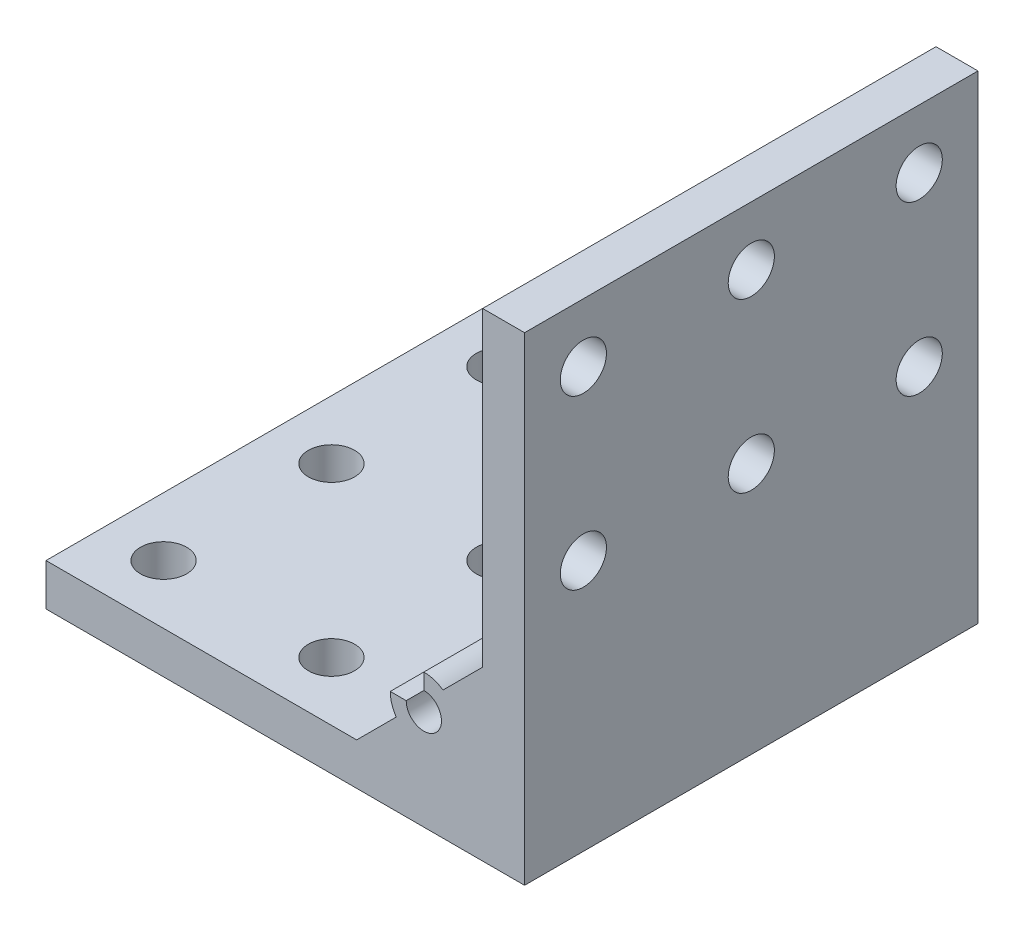
ISO-10303-21;
HEADER;
FILE_DESCRIPTION(('STEP AP214'),'2;1');
FILE_NAME('part.step','',(''),(''),'','','');
FILE_SCHEMA(('AUTOMOTIVE_DESIGN { 1 0 10303 214 1 1 1 1 }'));
ENDSEC;
DATA;
#1=APPLICATION_CONTEXT('core data for automotive mechanical design processes');
#2=APPLICATION_PROTOCOL_DEFINITION('international standard','automotive_design',2000,#1);
#3=PRODUCT_CONTEXT('',#1,'mechanical');
#4=PRODUCT('Part','Part','',(#3));
#5=PRODUCT_RELATED_PRODUCT_CATEGORY('part','',(#4));
#6=PRODUCT_DEFINITION_FORMATION('','',#4);
#7=PRODUCT_DEFINITION_CONTEXT('part definition',#1,'design');
#8=PRODUCT_DEFINITION('design','',#6,#7);
#9=PRODUCT_DEFINITION_SHAPE('','',#8);
#10=(LENGTH_UNIT() NAMED_UNIT(*) SI_UNIT(.MILLI.,.METRE.));
#11=(NAMED_UNIT(*) PLANE_ANGLE_UNIT() SI_UNIT($,.RADIAN.));
#12=(NAMED_UNIT(*) SI_UNIT($,.STERADIAN.) SOLID_ANGLE_UNIT());
#13=UNCERTAINTY_MEASURE_WITH_UNIT(LENGTH_MEASURE(1.E-05),#10,'distance_accuracy_value','');
#14=(GEOMETRIC_REPRESENTATION_CONTEXT(3) GLOBAL_UNCERTAINTY_ASSIGNED_CONTEXT((#13)) GLOBAL_UNIT_ASSIGNED_CONTEXT((#10,
#11,#12)) REPRESENTATION_CONTEXT('',''));
#15=CARTESIAN_POINT('',(0.,0.,0.));
#16=DIRECTION('',(0.,0.,1.));
#17=DIRECTION('',(1.,0.,0.));
#18=AXIS2_PLACEMENT_3D('',#15,#16,#17);
#19=CARTESIAN_POINT('',(0.,0.,27.));
#20=DIRECTION('',(0.,0.,-1.));
#21=DIRECTION('',(-1.,0.,0.));
#22=AXIS2_PLACEMENT_3D('',#19,#20,#21);
#23=CYLINDRICAL_SURFACE('',#22,2.1);
#24=DIRECTION('',(0.,0.,-1.));
#25=VECTOR('',#24,1.);
#26=CARTESIAN_POINT('',(0.,2.1,27.));
#27=LINE('',#26,#25);
#28=CARTESIAN_POINT('',(0.,2.1,27.));
#29=VERTEX_POINT('',#28);
#30=CARTESIAN_POINT('',(0.,2.1,-27.));
#31=VERTEX_POINT('',#30);
#32=EDGE_CURVE('E143',#29,#31,#27,.T.);
#33=ORIENTED_EDGE('',*,*,#32,.T.);
#34=CARTESIAN_POINT('',(0.,0.,-27.));
#35=DIRECTION('',(0.,0.,-1.));
#36=DIRECTION('',(1.,0.,0.));
#37=AXIS2_PLACEMENT_3D('',#34,#35,#36);
#38=CIRCLE('',#37,2.1);
#39=CARTESIAN_POINT('',(-2.1,0.,-27.));
#40=VERTEX_POINT('',#39);
#41=EDGE_CURVE('E137',#31,#40,#38,.T.);
#42=ORIENTED_EDGE('',*,*,#41,.T.);
#43=DIRECTION('',(0.,0.,-1.));
#44=VECTOR('',#43,1.);
#45=CARTESIAN_POINT('',(-2.1,0.,27.));
#46=LINE('',#45,#44);
#47=CARTESIAN_POINT('',(-2.1,0.,27.));
#48=VERTEX_POINT('',#47);
#49=EDGE_CURVE('E11',#48,#40,#46,.T.);
#50=ORIENTED_EDGE('',*,*,#49,.F.);
#51=CARTESIAN_POINT('',(0.,0.,27.));
#52=DIRECTION('',(0.,0.,-1.));
#53=DIRECTION('',(1.,0.,0.));
#54=AXIS2_PLACEMENT_3D('',#51,#52,#53);
#55=CIRCLE('',#54,2.1);
#56=EDGE_CURVE('E181',#29,#48,#55,.T.);
#57=ORIENTED_EDGE('',*,*,#56,.F.);
#58=EDGE_LOOP('',(#33,#42,#50,#57));
#59=FACE_BOUND('',#58,.T.);
#60=ADVANCED_FACE('F31',(#59),#23,.F.);
#61=CARTESIAN_POINT('',(-2.1,0.,27.));
#62=DIRECTION('',(0.,-1.,0.));
#63=DIRECTION('',(1.,0.,0.));
#64=AXIS2_PLACEMENT_3D('',#61,#62,#63);
#65=PLANE('',#64);
#66=ORIENTED_EDGE('',*,*,#49,.T.);
#67=DIRECTION('',(-1.,0.,0.));
#68=VECTOR('',#67,1.);
#69=CARTESIAN_POINT('',(-2.1,0.,-27.));
#70=LINE('',#69,#68);
#71=CARTESIAN_POINT('',(-4.,0.,-27.));
#72=VERTEX_POINT('',#71);
#73=EDGE_CURVE('E127',#40,#72,#70,.T.);
#74=ORIENTED_EDGE('',*,*,#73,.T.);
#75=DIRECTION('',(0.,0.,-1.));
#76=VECTOR('',#75,1.);
#77=CARTESIAN_POINT('',(-4.,0.,27.));
#78=LINE('',#77,#76);
#79=CARTESIAN_POINT('',(-4.,0.,27.));
#80=VERTEX_POINT('',#79);
#81=EDGE_CURVE('E38',#80,#72,#78,.T.);
#82=ORIENTED_EDGE('',*,*,#81,.F.);
#83=DIRECTION('',(-1.,0.,0.));
#84=VECTOR('',#83,1.);
#85=CARTESIAN_POINT('',(-2.1,0.,27.));
#86=LINE('',#85,#84);
#87=EDGE_CURVE('E128',#48,#80,#86,.T.);
#88=ORIENTED_EDGE('',*,*,#87,.F.);
#89=EDGE_LOOP('',(#66,#74,#82,#88));
#90=FACE_BOUND('',#89,.T.);
#91=ADVANCED_FACE('F125',(#90),#65,.F.);
#92=CARTESIAN_POINT('',(0.,0.,27.));
#93=DIRECTION('',(0.,0.,-1.));
#94=DIRECTION('',(-1.,0.,0.));
#95=AXIS2_PLACEMENT_3D('',#92,#93,#94);
#96=CYLINDRICAL_SURFACE('',#95,4.);
#97=ORIENTED_EDGE('',*,*,#81,.T.);
#98=CARTESIAN_POINT('',(0.,0.,-27.));
#99=DIRECTION('',(0.,0.,1.));
#100=DIRECTION('',(1.,0.,0.));
#101=AXIS2_PLACEMENT_3D('',#98,#99,#100);
#102=CIRCLE('',#101,4.);
#103=CARTESIAN_POINT('',(-3.28388218141501,-2.28388218141501,-27.));
#104=VERTEX_POINT('',#103);
#105=EDGE_CURVE('E141',#72,#104,#102,.T.);
#106=ORIENTED_EDGE('',*,*,#105,.T.);
#107=DIRECTION('',(0.,0.,-1.));
#108=VECTOR('',#107,1.);
#109=CARTESIAN_POINT('',(-3.28388218141501,-2.28388218141501,27.));
#110=LINE('',#109,#108);
#111=CARTESIAN_POINT('',(-3.28388218141501,-2.28388218141501,27.));
#112=VERTEX_POINT('',#111);
#113=EDGE_CURVE('E223',#112,#104,#110,.T.);
#114=ORIENTED_EDGE('',*,*,#113,.F.);
#115=CARTESIAN_POINT('',(0.,0.,27.));
#116=DIRECTION('',(0.,0.,1.));
#117=DIRECTION('',(1.,0.,0.));
#118=AXIS2_PLACEMENT_3D('',#115,#116,#117);
#119=CIRCLE('',#118,4.);
#120=EDGE_CURVE('E184',#80,#112,#119,.T.);
#121=ORIENTED_EDGE('',*,*,#120,.F.);
#122=EDGE_LOOP('',(#97,#106,#114,#121));
#123=FACE_BOUND('',#122,.T.);
#124=ADVANCED_FACE('F226',(#123),#96,.T.);
#125=CARTESIAN_POINT('',(-8.,-7.00000000000001,27.));
#126=DIRECTION('',(0.707106781186547,-0.707106781186547,0.));
#127=DIRECTION('',(0.707106781186548,0.707106781186548,0.));
#128=AXIS2_PLACEMENT_3D('',#125,#126,#127);
#129=PLANE('',#128);
#130=ORIENTED_EDGE('',*,*,#113,.T.);
#131=DIRECTION('',(-0.707106781186548,-0.707106781186548,0.));
#132=VECTOR('',#131,1.);
#133=CARTESIAN_POINT('',(-8.,-7.00000000000001,-27.));
#134=LINE('',#133,#132);
#135=CARTESIAN_POINT('',(-8.,-7.00000000000001,-27.));
#136=VERTEX_POINT('',#135);
#137=EDGE_CURVE('E152',#104,#136,#134,.T.);
#138=ORIENTED_EDGE('',*,*,#137,.T.);
#139=DIRECTION('',(0.,0.,-1.));
#140=VECTOR('',#139,1.);
#141=CARTESIAN_POINT('',(-8.,-7.00000000000001,27.));
#142=LINE('',#141,#140);
#143=CARTESIAN_POINT('',(-8.,-7.00000000000001,27.));
#144=VERTEX_POINT('',#143);
#145=EDGE_CURVE('E221',#144,#136,#142,.T.);
#146=ORIENTED_EDGE('',*,*,#145,.F.);
#147=DIRECTION('',(-0.707106781186548,-0.707106781186548,0.));
#148=VECTOR('',#147,1.);
#149=CARTESIAN_POINT('',(-8.,-7.00000000000001,27.));
#150=LINE('',#149,#148);
#151=EDGE_CURVE('E186',#112,#144,#150,.T.);
#152=ORIENTED_EDGE('',*,*,#151,.F.);
#153=EDGE_LOOP('',(#130,#138,#146,#152));
#154=FACE_BOUND('',#153,.T.);
#155=ADVANCED_FACE('F234',(#154),#129,.F.);
#156=CARTESIAN_POINT('',(-45.,-7.,27.));
#157=DIRECTION('',(0.,-1.,0.));
#158=DIRECTION('',(1.,0.,0.));
#159=AXIS2_PLACEMENT_3D('',#156,#157,#158);
#160=PLANE('',#159);
#161=CARTESIAN_POINT('',(-18.,-7.00000000000001,20.));
#162=DIRECTION('',(0.,-1.,0.));
#163=DIRECTION('',(1.,0.,0.));
#164=AXIS2_PLACEMENT_3D('',#161,#162,#163);
#165=CIRCLE('',#164,2.75);
#166=CARTESIAN_POINT('',(-15.25,-7.00000000000001,20.));
#167=VERTEX_POINT('',#166);
#168=EDGE_CURVE('E491',#167,#167,#165,.F.);
#169=ORIENTED_EDGE('',*,*,#168,.F.);
#170=EDGE_LOOP('',(#169));
#171=FACE_BOUND('',#170,.T.);
#172=CARTESIAN_POINT('',(-18.,-7.00000000000001,0.));
#173=DIRECTION('',(0.,-1.,0.));
#174=DIRECTION('',(1.,0.,0.));
#175=AXIS2_PLACEMENT_3D('',#172,#173,#174);
#176=CIRCLE('',#175,2.75);
#177=CARTESIAN_POINT('',(-15.25,-7.00000000000001,0.));
#178=VERTEX_POINT('',#177);
#179=EDGE_CURVE('E495',#178,#178,#176,.F.);
#180=ORIENTED_EDGE('',*,*,#179,.F.);
#181=EDGE_LOOP('',(#180));
#182=FACE_BOUND('',#181,.T.);
#183=CARTESIAN_POINT('',(-18.,-7.00000000000001,-20.));
#184=DIRECTION('',(0.,-1.,0.));
#185=DIRECTION('',(1.,0.,0.));
#186=AXIS2_PLACEMENT_3D('',#183,#184,#185);
#187=CIRCLE('',#186,2.75);
#188=CARTESIAN_POINT('',(-15.25,-7.00000000000001,-20.));
#189=VERTEX_POINT('',#188);
#190=EDGE_CURVE('E504',#189,#189,#187,.F.);
#191=ORIENTED_EDGE('',*,*,#190,.F.);
#192=EDGE_LOOP('',(#191));
#193=FACE_BOUND('',#192,.T.);
#194=CARTESIAN_POINT('',(-38.,-7.,20.));
#195=DIRECTION('',(0.,-1.,0.));
#196=DIRECTION('',(1.,0.,0.));
#197=AXIS2_PLACEMENT_3D('',#194,#195,#196);
#198=CIRCLE('',#197,2.75);
#199=CARTESIAN_POINT('',(-35.25,-7.,20.));
#200=VERTEX_POINT('',#199);
#201=EDGE_CURVE('E510',#200,#200,#198,.F.);
#202=ORIENTED_EDGE('',*,*,#201,.F.);
#203=EDGE_LOOP('',(#202));
#204=FACE_BOUND('',#203,.T.);
#205=CARTESIAN_POINT('',(-38.,-7.,0.));
#206=DIRECTION('',(0.,-1.,0.));
#207=DIRECTION('',(1.,0.,0.));
#208=AXIS2_PLACEMENT_3D('',#205,#206,#207);
#209=CIRCLE('',#208,2.75);
#210=CARTESIAN_POINT('',(-35.25,-7.,0.));
#211=VERTEX_POINT('',#210);
#212=EDGE_CURVE('E516',#211,#211,#209,.F.);
#213=ORIENTED_EDGE('',*,*,#212,.F.);
#214=EDGE_LOOP('',(#213));
#215=FACE_BOUND('',#214,.T.);
#216=CARTESIAN_POINT('',(-38.,-7.,-20.));
#217=DIRECTION('',(0.,-1.,0.));
#218=DIRECTION('',(1.,0.,0.));
#219=AXIS2_PLACEMENT_3D('',#216,#217,#218);
#220=CIRCLE('',#219,2.75);
#221=CARTESIAN_POINT('',(-35.25,-7.,-20.));
#222=VERTEX_POINT('',#221);
#223=EDGE_CURVE('E522',#222,#222,#220,.F.);
#224=ORIENTED_EDGE('',*,*,#223,.F.);
#225=EDGE_LOOP('',(#224));
#226=FACE_BOUND('',#225,.T.);
#227=ORIENTED_EDGE('',*,*,#145,.T.);
#228=DIRECTION('',(-1.,0.,0.));
#229=VECTOR('',#228,1.);
#230=CARTESIAN_POINT('',(-45.,-7.,-27.));
#231=LINE('',#230,#229);
#232=CARTESIAN_POINT('',(-45.,-7.,-27.));
#233=VERTEX_POINT('',#232);
#234=EDGE_CURVE('E155',#136,#233,#231,.T.);
#235=ORIENTED_EDGE('',*,*,#234,.T.);
#236=DIRECTION('',(0.,0.,-1.));
#237=VECTOR('',#236,1.);
#238=CARTESIAN_POINT('',(-45.,-7.,27.));
#239=LINE('',#238,#237);
#240=CARTESIAN_POINT('',(-45.,-7.,27.));
#241=VERTEX_POINT('',#240);
#242=EDGE_CURVE('E219',#241,#233,#239,.T.);
#243=ORIENTED_EDGE('',*,*,#242,.F.);
#244=DIRECTION('',(-1.,0.,0.));
#245=VECTOR('',#244,1.);
#246=CARTESIAN_POINT('',(-45.,-7.,27.));
#247=LINE('',#246,#245);
#248=EDGE_CURVE('E188',#144,#241,#247,.T.);
#249=ORIENTED_EDGE('',*,*,#248,.F.);
#250=EDGE_LOOP('',(#227,#235,#243,#249));
#251=FACE_BOUND('',#250,.T.);
#252=ADVANCED_FACE('F237',(#171,#182,#193,#204,#215,#226,#251),#160,.F.);
#253=CARTESIAN_POINT('',(-45.,-12.,27.));
#254=DIRECTION('',(1.,0.,0.));
#255=DIRECTION('',(0.,1.,0.));
#256=AXIS2_PLACEMENT_3D('',#253,#254,#255);
#257=PLANE('',#256);
#258=ORIENTED_EDGE('',*,*,#242,.T.);
#259=DIRECTION('',(0.,-1.,0.));
#260=VECTOR('',#259,1.);
#261=CARTESIAN_POINT('',(-45.,-12.,-27.));
#262=LINE('',#261,#260);
#263=CARTESIAN_POINT('',(-45.,-12.,-27.));
#264=VERTEX_POINT('',#263);
#265=EDGE_CURVE('E158',#233,#264,#262,.T.);
#266=ORIENTED_EDGE('',*,*,#265,.T.);
#267=DIRECTION('',(0.,0.,-1.));
#268=VECTOR('',#267,1.);
#269=CARTESIAN_POINT('',(-45.,-12.,27.));
#270=LINE('',#269,#268);
#271=CARTESIAN_POINT('',(-45.,-12.,27.));
#272=VERTEX_POINT('',#271);
#273=EDGE_CURVE('E217',#272,#264,#270,.T.);
#274=ORIENTED_EDGE('',*,*,#273,.F.);
#275=DIRECTION('',(0.,-1.,0.));
#276=VECTOR('',#275,1.);
#277=CARTESIAN_POINT('',(-45.,-12.,27.));
#278=LINE('',#277,#276);
#279=EDGE_CURVE('E190',#241,#272,#278,.T.);
#280=ORIENTED_EDGE('',*,*,#279,.F.);
#281=EDGE_LOOP('',(#258,#266,#274,#280));
#282=FACE_BOUND('',#281,.T.);
#283=ADVANCED_FACE('F242',(#282),#257,.F.);
#284=CARTESIAN_POINT('',(12.,-12.,27.));
#285=DIRECTION('',(0.,1.,0.));
#286=DIRECTION('',(-1.,0.,0.));
#287=AXIS2_PLACEMENT_3D('',#284,#285,#286);
#288=PLANE('',#287);
#289=CARTESIAN_POINT('',(-18.,-12.,20.));
#290=DIRECTION('',(0.,-1.,0.));
#291=DIRECTION('',(1.,0.,0.));
#292=AXIS2_PLACEMENT_3D('',#289,#290,#291);
#293=CIRCLE('',#292,2.75);
#294=CARTESIAN_POINT('',(-15.25,-12.,20.));
#295=VERTEX_POINT('',#294);
#296=EDGE_CURVE('E488',#295,#295,#293,.T.);
#297=ORIENTED_EDGE('',*,*,#296,.F.);
#298=EDGE_LOOP('',(#297));
#299=FACE_BOUND('',#298,.T.);
#300=CARTESIAN_POINT('',(-18.,-12.,0.));
#301=DIRECTION('',(0.,-1.,0.));
#302=DIRECTION('',(1.,0.,0.));
#303=AXIS2_PLACEMENT_3D('',#300,#301,#302);
#304=CIRCLE('',#303,2.75);
#305=CARTESIAN_POINT('',(-15.25,-12.,0.));
#306=VERTEX_POINT('',#305);
#307=EDGE_CURVE('E492',#306,#306,#304,.T.);
#308=ORIENTED_EDGE('',*,*,#307,.F.);
#309=EDGE_LOOP('',(#308));
#310=FACE_BOUND('',#309,.T.);
#311=CARTESIAN_POINT('',(-18.,-12.,-20.));
#312=DIRECTION('',(0.,-1.,0.));
#313=DIRECTION('',(1.,0.,0.));
#314=AXIS2_PLACEMENT_3D('',#311,#312,#313);
#315=CIRCLE('',#314,2.75);
#316=CARTESIAN_POINT('',(-15.25,-12.,-20.));
#317=VERTEX_POINT('',#316);
#318=EDGE_CURVE('E501',#317,#317,#315,.T.);
#319=ORIENTED_EDGE('',*,*,#318,.F.);
#320=EDGE_LOOP('',(#319));
#321=FACE_BOUND('',#320,.T.);
#322=CARTESIAN_POINT('',(-38.,-12.,20.));
#323=DIRECTION('',(0.,-1.,0.));
#324=DIRECTION('',(1.,0.,0.));
#325=AXIS2_PLACEMENT_3D('',#322,#323,#324);
#326=CIRCLE('',#325,2.75);
#327=CARTESIAN_POINT('',(-35.25,-12.,20.));
#328=VERTEX_POINT('',#327);
#329=EDGE_CURVE('E507',#328,#328,#326,.T.);
#330=ORIENTED_EDGE('',*,*,#329,.F.);
#331=EDGE_LOOP('',(#330));
#332=FACE_BOUND('',#331,.T.);
#333=CARTESIAN_POINT('',(-38.,-12.,0.));
#334=DIRECTION('',(0.,-1.,0.));
#335=DIRECTION('',(1.,0.,0.));
#336=AXIS2_PLACEMENT_3D('',#333,#334,#335);
#337=CIRCLE('',#336,2.75);
#338=CARTESIAN_POINT('',(-35.25,-12.,0.));
#339=VERTEX_POINT('',#338);
#340=EDGE_CURVE('E513',#339,#339,#337,.T.);
#341=ORIENTED_EDGE('',*,*,#340,.F.);
#342=EDGE_LOOP('',(#341));
#343=FACE_BOUND('',#342,.T.);
#344=CARTESIAN_POINT('',(-38.,-12.,-20.));
#345=DIRECTION('',(0.,-1.,0.));
#346=DIRECTION('',(1.,0.,0.));
#347=AXIS2_PLACEMENT_3D('',#344,#345,#346);
#348=CIRCLE('',#347,2.75);
#349=CARTESIAN_POINT('',(-35.25,-12.,-20.));
#350=VERTEX_POINT('',#349);
#351=EDGE_CURVE('E519',#350,#350,#348,.T.);
#352=ORIENTED_EDGE('',*,*,#351,.F.);
#353=EDGE_LOOP('',(#352));
#354=FACE_BOUND('',#353,.T.);
#355=ORIENTED_EDGE('',*,*,#273,.T.);
#356=DIRECTION('',(1.,0.,0.));
#357=VECTOR('',#356,1.);
#358=CARTESIAN_POINT('',(12.,-12.,-27.));
#359=LINE('',#358,#357);
#360=CARTESIAN_POINT('',(12.,-12.,-27.));
#361=VERTEX_POINT('',#360);
#362=EDGE_CURVE('E161',#264,#361,#359,.T.);
#363=ORIENTED_EDGE('',*,*,#362,.T.);
#364=DIRECTION('',(0.,0.,-1.));
#365=VECTOR('',#364,1.);
#366=CARTESIAN_POINT('',(12.,-12.,27.));
#367=LINE('',#366,#365);
#368=CARTESIAN_POINT('',(12.,-12.,27.));
#369=VERTEX_POINT('',#368);
#370=EDGE_CURVE('E215',#369,#361,#367,.T.);
#371=ORIENTED_EDGE('',*,*,#370,.F.);
#372=DIRECTION('',(1.,0.,0.));
#373=VECTOR('',#372,1.);
#374=CARTESIAN_POINT('',(12.,-12.,27.));
#375=LINE('',#374,#373);
#376=EDGE_CURVE('E192',#272,#369,#375,.T.);
#377=ORIENTED_EDGE('',*,*,#376,.F.);
#378=EDGE_LOOP('',(#355,#363,#371,#377));
#379=FACE_BOUND('',#378,.T.);
#380=ADVANCED_FACE('F248',(#299,#310,#321,#332,#343,#354,#379),#288,.F.);
#381=CARTESIAN_POINT('',(12.,45.,27.));
#382=DIRECTION('',(-1.,0.,0.));
#383=DIRECTION('',(0.,-1.,0.));
#384=AXIS2_PLACEMENT_3D('',#381,#382,#383);
#385=PLANE('',#384);
#386=CARTESIAN_POINT('',(12.,18.,-20.));
#387=DIRECTION('',(1.,0.,0.));
#388=DIRECTION('',(0.,1.,0.));
#389=AXIS2_PLACEMENT_3D('',#386,#387,#388);
#390=CIRCLE('',#389,2.75);
#391=CARTESIAN_POINT('',(12.,20.75,-20.));
#392=VERTEX_POINT('',#391);
#393=EDGE_CURVE('E525',#392,#392,#390,.T.);
#394=ORIENTED_EDGE('',*,*,#393,.F.);
#395=EDGE_LOOP('',(#394));
#396=FACE_BOUND('',#395,.T.);
#397=CARTESIAN_POINT('',(12.,18.,0.));
#398=DIRECTION('',(1.,0.,0.));
#399=DIRECTION('',(0.,1.,0.));
#400=AXIS2_PLACEMENT_3D('',#397,#398,#399);
#401=CIRCLE('',#400,2.75);
#402=CARTESIAN_POINT('',(12.,20.75,0.));
#403=VERTEX_POINT('',#402);
#404=EDGE_CURVE('E531',#403,#403,#401,.T.);
#405=ORIENTED_EDGE('',*,*,#404,.F.);
#406=EDGE_LOOP('',(#405));
#407=FACE_BOUND('',#406,.T.);
#408=CARTESIAN_POINT('',(12.,18.,20.));
#409=DIRECTION('',(1.,0.,0.));
#410=DIRECTION('',(0.,1.,0.));
#411=AXIS2_PLACEMENT_3D('',#408,#409,#410);
#412=CIRCLE('',#411,2.75);
#413=CARTESIAN_POINT('',(12.,20.75,20.));
#414=VERTEX_POINT('',#413);
#415=EDGE_CURVE('E537',#414,#414,#412,.T.);
#416=ORIENTED_EDGE('',*,*,#415,.F.);
#417=EDGE_LOOP('',(#416));
#418=FACE_BOUND('',#417,.T.);
#419=CARTESIAN_POINT('',(12.,38.,-20.));
#420=DIRECTION('',(1.,0.,0.));
#421=DIRECTION('',(0.,1.,0.));
#422=AXIS2_PLACEMENT_3D('',#419,#420,#421);
#423=CIRCLE('',#422,2.75);
#424=CARTESIAN_POINT('',(12.,40.75,-20.));
#425=VERTEX_POINT('',#424);
#426=EDGE_CURVE('E543',#425,#425,#423,.T.);
#427=ORIENTED_EDGE('',*,*,#426,.F.);
#428=EDGE_LOOP('',(#427));
#429=FACE_BOUND('',#428,.T.);
#430=CARTESIAN_POINT('',(12.,38.,0.));
#431=DIRECTION('',(1.,0.,0.));
#432=DIRECTION('',(0.,1.,0.));
#433=AXIS2_PLACEMENT_3D('',#430,#431,#432);
#434=CIRCLE('',#433,2.75);
#435=CARTESIAN_POINT('',(12.,40.75,0.));
#436=VERTEX_POINT('',#435);
#437=EDGE_CURVE('E549',#436,#436,#434,.T.);
#438=ORIENTED_EDGE('',*,*,#437,.F.);
#439=EDGE_LOOP('',(#438));
#440=FACE_BOUND('',#439,.T.);
#441=CARTESIAN_POINT('',(12.,38.,20.));
#442=DIRECTION('',(1.,0.,0.));
#443=DIRECTION('',(0.,1.,0.));
#444=AXIS2_PLACEMENT_3D('',#441,#442,#443);
#445=CIRCLE('',#444,2.75);
#446=CARTESIAN_POINT('',(12.,40.75,20.));
#447=VERTEX_POINT('',#446);
#448=EDGE_CURVE('E147',#447,#447,#445,.T.);
#449=ORIENTED_EDGE('',*,*,#448,.F.);
#450=EDGE_LOOP('',(#449));
#451=FACE_BOUND('',#450,.T.);
#452=ORIENTED_EDGE('',*,*,#370,.T.);
#453=DIRECTION('',(0.,1.,0.));
#454=VECTOR('',#453,1.);
#455=CARTESIAN_POINT('',(12.,45.,-27.));
#456=LINE('',#455,#454);
#457=CARTESIAN_POINT('',(12.,45.,-27.));
#458=VERTEX_POINT('',#457);
#459=EDGE_CURVE('E164',#361,#458,#456,.T.);
#460=ORIENTED_EDGE('',*,*,#459,.T.);
#461=DIRECTION('',(0.,0.,-1.));
#462=VECTOR('',#461,1.);
#463=CARTESIAN_POINT('',(12.,45.,27.));
#464=LINE('',#463,#462);
#465=CARTESIAN_POINT('',(12.,45.,27.));
#466=VERTEX_POINT('',#465);
#467=EDGE_CURVE('E213',#466,#458,#464,.T.);
#468=ORIENTED_EDGE('',*,*,#467,.F.);
#469=DIRECTION('',(0.,1.,0.));
#470=VECTOR('',#469,1.);
#471=CARTESIAN_POINT('',(12.,45.,27.));
#472=LINE('',#471,#470);
#473=EDGE_CURVE('E194',#369,#466,#472,.T.);
#474=ORIENTED_EDGE('',*,*,#473,.F.);
#475=EDGE_LOOP('',(#452,#460,#468,#474));
#476=FACE_BOUND('',#475,.T.);
#477=ADVANCED_FACE('F252',(#396,#407,#418,#429,#440,#451,#476),#385,.F.);
#478=CARTESIAN_POINT('',(7.00000000000001,45.,27.));
#479=DIRECTION('',(0.,-1.,0.));
#480=DIRECTION('',(0.,0.,-1.));
#481=AXIS2_PLACEMENT_3D('',#478,#479,#480);
#482=PLANE('',#481);
#483=ORIENTED_EDGE('',*,*,#467,.T.);
#484=DIRECTION('',(-1.,0.,0.));
#485=VECTOR('',#484,1.);
#486=CARTESIAN_POINT('',(7.00000000000001,45.,-27.));
#487=LINE('',#486,#485);
#488=CARTESIAN_POINT('',(7.00000000000001,45.,-27.));
#489=VERTEX_POINT('',#488);
#490=EDGE_CURVE('E167',#458,#489,#487,.T.);
#491=ORIENTED_EDGE('',*,*,#490,.T.);
#492=DIRECTION('',(0.,0.,-1.));
#493=VECTOR('',#492,1.);
#494=CARTESIAN_POINT('',(7.00000000000001,45.,27.));
#495=LINE('',#494,#493);
#496=CARTESIAN_POINT('',(7.00000000000001,45.,27.));
#497=VERTEX_POINT('',#496);
#498=EDGE_CURVE('E211',#497,#489,#495,.T.);
#499=ORIENTED_EDGE('',*,*,#498,.F.);
#500=DIRECTION('',(-1.,0.,0.));
#501=VECTOR('',#500,1.);
#502=CARTESIAN_POINT('',(7.00000000000001,45.,27.));
#503=LINE('',#502,#501);
#504=EDGE_CURVE('E196',#466,#497,#503,.T.);
#505=ORIENTED_EDGE('',*,*,#504,.F.);
#506=EDGE_LOOP('',(#483,#491,#499,#505));
#507=FACE_BOUND('',#506,.T.);
#508=ADVANCED_FACE('F257',(#507),#482,.F.);
#509=CARTESIAN_POINT('',(7.00000000000001,8.,27.));
#510=DIRECTION('',(1.,0.,0.));
#511=DIRECTION('',(0.,0.,-1.));
#512=AXIS2_PLACEMENT_3D('',#509,#510,#511);
#513=PLANE('',#512);
#514=CARTESIAN_POINT('',(7.00000000000001,18.,-20.));
#515=DIRECTION('',(1.,0.,0.));
#516=DIRECTION('',(0.,0.,-1.));
#517=AXIS2_PLACEMENT_3D('',#514,#515,#516);
#518=CIRCLE('',#517,2.75);
#519=CARTESIAN_POINT('',(7.00000000000001,18.,-22.75));
#520=VERTEX_POINT('',#519);
#521=EDGE_CURVE('E528',#520,#520,#518,.F.);
#522=ORIENTED_EDGE('',*,*,#521,.F.);
#523=EDGE_LOOP('',(#522));
#524=FACE_BOUND('',#523,.T.);
#525=CARTESIAN_POINT('',(7.00000000000001,18.,0.));
#526=DIRECTION('',(1.,0.,0.));
#527=DIRECTION('',(0.,0.,-1.));
#528=AXIS2_PLACEMENT_3D('',#525,#526,#527);
#529=CIRCLE('',#528,2.75);
#530=CARTESIAN_POINT('',(7.00000000000001,18.,-2.75));
#531=VERTEX_POINT('',#530);
#532=EDGE_CURVE('E534',#531,#531,#529,.F.);
#533=ORIENTED_EDGE('',*,*,#532,.F.);
#534=EDGE_LOOP('',(#533));
#535=FACE_BOUND('',#534,.T.);
#536=CARTESIAN_POINT('',(7.00000000000001,18.,20.));
#537=DIRECTION('',(1.,0.,0.));
#538=DIRECTION('',(0.,0.,-1.));
#539=AXIS2_PLACEMENT_3D('',#536,#537,#538);
#540=CIRCLE('',#539,2.75);
#541=CARTESIAN_POINT('',(7.00000000000001,18.,17.25));
#542=VERTEX_POINT('',#541);
#543=EDGE_CURVE('E540',#542,#542,#540,.F.);
#544=ORIENTED_EDGE('',*,*,#543,.F.);
#545=EDGE_LOOP('',(#544));
#546=FACE_BOUND('',#545,.T.);
#547=CARTESIAN_POINT('',(7.00000000000001,38.,-20.));
#548=DIRECTION('',(1.,0.,0.));
#549=DIRECTION('',(0.,0.,-1.));
#550=AXIS2_PLACEMENT_3D('',#547,#548,#549);
#551=CIRCLE('',#550,2.75);
#552=CARTESIAN_POINT('',(7.00000000000001,38.,-22.75));
#553=VERTEX_POINT('',#552);
#554=EDGE_CURVE('E546',#553,#553,#551,.F.);
#555=ORIENTED_EDGE('',*,*,#554,.F.);
#556=EDGE_LOOP('',(#555));
#557=FACE_BOUND('',#556,.T.);
#558=CARTESIAN_POINT('',(7.00000000000001,38.,0.));
#559=DIRECTION('',(1.,0.,0.));
#560=DIRECTION('',(0.,0.,-1.));
#561=AXIS2_PLACEMENT_3D('',#558,#559,#560);
#562=CIRCLE('',#561,2.75);
#563=CARTESIAN_POINT('',(7.00000000000001,38.,-2.75));
#564=VERTEX_POINT('',#563);
#565=EDGE_CURVE('E552',#564,#564,#562,.F.);
#566=ORIENTED_EDGE('',*,*,#565,.F.);
#567=EDGE_LOOP('',(#566));
#568=FACE_BOUND('',#567,.T.);
#569=CARTESIAN_POINT('',(7.00000000000001,38.,20.));
#570=DIRECTION('',(1.,0.,0.));
#571=DIRECTION('',(0.,0.,-1.));
#572=AXIS2_PLACEMENT_3D('',#569,#570,#571);
#573=CIRCLE('',#572,2.75);
#574=CARTESIAN_POINT('',(7.00000000000001,38.,17.25));
#575=VERTEX_POINT('',#574);
#576=EDGE_CURVE('E144',#575,#575,#573,.F.);
#577=ORIENTED_EDGE('',*,*,#576,.F.);
#578=EDGE_LOOP('',(#577));
#579=FACE_BOUND('',#578,.T.);
#580=ORIENTED_EDGE('',*,*,#498,.T.);
#581=DIRECTION('',(0.,-1.,0.));
#582=VECTOR('',#581,1.);
#583=CARTESIAN_POINT('',(7.00000000000001,8.,-27.));
#584=LINE('',#583,#582);
#585=CARTESIAN_POINT('',(7.00000000000001,8.,-27.));
#586=VERTEX_POINT('',#585);
#587=EDGE_CURVE('E170',#489,#586,#584,.T.);
#588=ORIENTED_EDGE('',*,*,#587,.T.);
#589=DIRECTION('',(0.,0.,-1.));
#590=VECTOR('',#589,1.);
#591=CARTESIAN_POINT('',(7.00000000000001,8.,27.));
#592=LINE('',#591,#590);
#593=CARTESIAN_POINT('',(7.00000000000001,8.,27.));
#594=VERTEX_POINT('',#593);
#595=EDGE_CURVE('E209',#594,#586,#592,.T.);
#596=ORIENTED_EDGE('',*,*,#595,.F.);
#597=DIRECTION('',(0.,-1.,0.));
#598=VECTOR('',#597,1.);
#599=CARTESIAN_POINT('',(7.00000000000001,8.,27.));
#600=LINE('',#599,#598);
#601=EDGE_CURVE('E198',#497,#594,#600,.T.);
#602=ORIENTED_EDGE('',*,*,#601,.F.);
#603=EDGE_LOOP('',(#580,#588,#596,#602));
#604=FACE_BOUND('',#603,.T.);
#605=ADVANCED_FACE('F263',(#524,#535,#546,#557,#568,#579,#604),#513,.F.);
#606=CARTESIAN_POINT('',(2.28388218141502,3.28388218141501,27.));
#607=DIRECTION('',(0.707106781186547,-0.707106781186547,0.));
#608=DIRECTION('',(0.707106781186548,0.707106781186548,0.));
#609=AXIS2_PLACEMENT_3D('',#606,#607,#608);
#610=PLANE('',#609);
#611=ORIENTED_EDGE('',*,*,#595,.T.);
#612=DIRECTION('',(-0.707106781186548,-0.707106781186548,0.));
#613=VECTOR('',#612,1.);
#614=CARTESIAN_POINT('',(2.28388218141502,3.28388218141501,-27.));
#615=LINE('',#614,#613);
#616=CARTESIAN_POINT('',(2.28388218141502,3.28388218141501,-27.));
#617=VERTEX_POINT('',#616);
#618=EDGE_CURVE('E173',#586,#617,#615,.T.);
#619=ORIENTED_EDGE('',*,*,#618,.T.);
#620=DIRECTION('',(0.,0.,-1.));
#621=VECTOR('',#620,1.);
#622=CARTESIAN_POINT('',(2.28388218141502,3.28388218141501,27.));
#623=LINE('',#622,#621);
#624=CARTESIAN_POINT('',(2.28388218141502,3.28388218141501,27.));
#625=VERTEX_POINT('',#624);
#626=EDGE_CURVE('E207',#625,#617,#623,.T.);
#627=ORIENTED_EDGE('',*,*,#626,.F.);
#628=DIRECTION('',(-0.707106781186548,-0.707106781186548,0.));
#629=VECTOR('',#628,1.);
#630=CARTESIAN_POINT('',(2.28388218141502,3.28388218141501,27.));
#631=LINE('',#630,#629);
#632=EDGE_CURVE('E200',#594,#625,#631,.T.);
#633=ORIENTED_EDGE('',*,*,#632,.F.);
#634=EDGE_LOOP('',(#611,#619,#627,#633));
#635=FACE_BOUND('',#634,.T.);
#636=ADVANCED_FACE('F267',(#635),#610,.F.);
#637=CARTESIAN_POINT('',(0.,0.,27.));
#638=DIRECTION('',(0.,0.,-1.));
#639=DIRECTION('',(-1.,0.,0.));
#640=AXIS2_PLACEMENT_3D('',#637,#638,#639);
#641=CYLINDRICAL_SURFACE('',#640,4.);
#642=ORIENTED_EDGE('',*,*,#626,.T.);
#643=CARTESIAN_POINT('',(0.,0.,-27.));
#644=DIRECTION('',(0.,0.,1.));
#645=DIRECTION('',(1.,0.,0.));
#646=AXIS2_PLACEMENT_3D('',#643,#644,#645);
#647=CIRCLE('',#646,4.);
#648=CARTESIAN_POINT('',(0.,4.,-27.));
#649=VERTEX_POINT('',#648);
#650=EDGE_CURVE('E176',#617,#649,#647,.T.);
#651=ORIENTED_EDGE('',*,*,#650,.T.);
#652=DIRECTION('',(0.,0.,-1.));
#653=VECTOR('',#652,1.);
#654=CARTESIAN_POINT('',(0.,4.,27.));
#655=LINE('',#654,#653);
#656=CARTESIAN_POINT('',(0.,4.,27.));
#657=VERTEX_POINT('',#656);
#658=EDGE_CURVE('E205',#657,#649,#655,.T.);
#659=ORIENTED_EDGE('',*,*,#658,.F.);
#660=CARTESIAN_POINT('',(0.,0.,27.));
#661=DIRECTION('',(0.,0.,1.));
#662=DIRECTION('',(1.,0.,0.));
#663=AXIS2_PLACEMENT_3D('',#660,#661,#662);
#664=CIRCLE('',#663,4.);
#665=EDGE_CURVE('E50',#625,#657,#664,.T.);
#666=ORIENTED_EDGE('',*,*,#665,.F.);
#667=EDGE_LOOP('',(#642,#651,#659,#666));
#668=FACE_BOUND('',#667,.T.);
#669=ADVANCED_FACE('F270',(#668),#641,.T.);
#670=CARTESIAN_POINT('',(0.,2.1,27.));
#671=DIRECTION('',(1.,0.,0.));
#672=DIRECTION('',(0.,1.,0.));
#673=AXIS2_PLACEMENT_3D('',#670,#671,#672);
#674=PLANE('',#673);
#675=ORIENTED_EDGE('',*,*,#658,.T.);
#676=DIRECTION('',(0.,-1.,0.));
#677=VECTOR('',#676,1.);
#678=CARTESIAN_POINT('',(0.,2.1,-27.));
#679=LINE('',#678,#677);
#680=EDGE_CURVE('E179',#649,#31,#679,.T.);
#681=ORIENTED_EDGE('',*,*,#680,.T.);
#682=ORIENTED_EDGE('',*,*,#32,.F.);
#683=DIRECTION('',(0.,-1.,0.));
#684=VECTOR('',#683,1.);
#685=CARTESIAN_POINT('',(0.,2.1,27.));
#686=LINE('',#685,#684);
#687=EDGE_CURVE('E45',#657,#29,#686,.T.);
#688=ORIENTED_EDGE('',*,*,#687,.F.);
#689=EDGE_LOOP('',(#675,#681,#682,#688));
#690=FACE_BOUND('',#689,.T.);
#691=ADVANCED_FACE('F272',(#690),#674,.F.);
#692=CARTESIAN_POINT('',(0.,0.,27.));
#693=DIRECTION('',(0.,0.,1.));
#694=DIRECTION('',(1.,0.,0.));
#695=AXIS2_PLACEMENT_3D('',#692,#693,#694);
#696=PLANE('',#695);
#697=ORIENTED_EDGE('',*,*,#56,.T.);
#698=ORIENTED_EDGE('',*,*,#87,.T.);
#699=ORIENTED_EDGE('',*,*,#120,.T.);
#700=ORIENTED_EDGE('',*,*,#151,.T.);
#701=ORIENTED_EDGE('',*,*,#248,.T.);
#702=ORIENTED_EDGE('',*,*,#279,.T.);
#703=ORIENTED_EDGE('',*,*,#376,.T.);
#704=ORIENTED_EDGE('',*,*,#473,.T.);
#705=ORIENTED_EDGE('',*,*,#504,.T.);
#706=ORIENTED_EDGE('',*,*,#601,.T.);
#707=ORIENTED_EDGE('',*,*,#632,.T.);
#708=ORIENTED_EDGE('',*,*,#665,.T.);
#709=ORIENTED_EDGE('',*,*,#687,.T.);
#710=EDGE_LOOP('',(#697,#698,#699,#700,#701,#702,#703,#704,#705,#706,#707,#708,#709));
#711=FACE_BOUND('',#710,.T.);
#712=ADVANCED_FACE('F229',(#711),#696,.T.);
#713=CARTESIAN_POINT('',(0.,0.,-27.));
#714=DIRECTION('',(0.,0.,1.));
#715=DIRECTION('',(1.,0.,0.));
#716=AXIS2_PLACEMENT_3D('',#713,#714,#715);
#717=PLANE('',#716);
#718=ORIENTED_EDGE('',*,*,#41,.F.);
#719=ORIENTED_EDGE('',*,*,#680,.F.);
#720=ORIENTED_EDGE('',*,*,#650,.F.);
#721=ORIENTED_EDGE('',*,*,#618,.F.);
#722=ORIENTED_EDGE('',*,*,#587,.F.);
#723=ORIENTED_EDGE('',*,*,#490,.F.);
#724=ORIENTED_EDGE('',*,*,#459,.F.);
#725=ORIENTED_EDGE('',*,*,#362,.F.);
#726=ORIENTED_EDGE('',*,*,#265,.F.);
#727=ORIENTED_EDGE('',*,*,#234,.F.);
#728=ORIENTED_EDGE('',*,*,#137,.F.);
#729=ORIENTED_EDGE('',*,*,#105,.F.);
#730=ORIENTED_EDGE('',*,*,#73,.F.);
#731=EDGE_LOOP('',(#718,#719,#720,#721,#722,#723,#724,#725,#726,#727,#728,#729,#730));
#732=FACE_BOUND('',#731,.T.);
#733=ADVANCED_FACE('F135',(#732),#717,.F.);
#734=CARTESIAN_POINT('',(-45.001,38.,20.));
#735=DIRECTION('',(1.,0.,0.));
#736=DIRECTION('',(0.,1.,0.));
#737=AXIS2_PLACEMENT_3D('',#734,#735,#736);
#738=CYLINDRICAL_SURFACE('',#737,2.75);
#739=ORIENTED_EDGE('',*,*,#448,.T.);
#740=EDGE_LOOP('',(#739));
#741=FACE_BOUND('',#740,.T.);
#742=ORIENTED_EDGE('',*,*,#576,.T.);
#743=EDGE_LOOP('',(#742));
#744=FACE_BOUND('',#743,.T.);
#745=ADVANCED_FACE('F337',(#741,#744),#738,.F.);
#746=CARTESIAN_POINT('',(-45.001,38.,0.));
#747=DIRECTION('',(1.,0.,0.));
#748=DIRECTION('',(0.,1.,0.));
#749=AXIS2_PLACEMENT_3D('',#746,#747,#748);
#750=CYLINDRICAL_SURFACE('',#749,2.75);
#751=ORIENTED_EDGE('',*,*,#437,.T.);
#752=EDGE_LOOP('',(#751));
#753=FACE_BOUND('',#752,.T.);
#754=ORIENTED_EDGE('',*,*,#565,.T.);
#755=EDGE_LOOP('',(#754));
#756=FACE_BOUND('',#755,.T.);
#757=ADVANCED_FACE('F358',(#753,#756),#750,.F.);
#758=CARTESIAN_POINT('',(-45.001,38.,-20.));
#759=DIRECTION('',(1.,0.,0.));
#760=DIRECTION('',(0.,1.,0.));
#761=AXIS2_PLACEMENT_3D('',#758,#759,#760);
#762=CYLINDRICAL_SURFACE('',#761,2.75);
#763=ORIENTED_EDGE('',*,*,#426,.T.);
#764=EDGE_LOOP('',(#763));
#765=FACE_BOUND('',#764,.T.);
#766=ORIENTED_EDGE('',*,*,#554,.T.);
#767=EDGE_LOOP('',(#766));
#768=FACE_BOUND('',#767,.T.);
#769=ADVANCED_FACE('F368',(#765,#768),#762,.F.);
#770=CARTESIAN_POINT('',(-45.001,18.,20.));
#771=DIRECTION('',(1.,0.,0.));
#772=DIRECTION('',(0.,1.,0.));
#773=AXIS2_PLACEMENT_3D('',#770,#771,#772);
#774=CYLINDRICAL_SURFACE('',#773,2.75);
#775=ORIENTED_EDGE('',*,*,#415,.T.);
#776=EDGE_LOOP('',(#775));
#777=FACE_BOUND('',#776,.T.);
#778=ORIENTED_EDGE('',*,*,#543,.T.);
#779=EDGE_LOOP('',(#778));
#780=FACE_BOUND('',#779,.T.);
#781=ADVANCED_FACE('F378',(#777,#780),#774,.F.);
#782=CARTESIAN_POINT('',(-45.001,18.,0.));
#783=DIRECTION('',(1.,0.,0.));
#784=DIRECTION('',(0.,1.,0.));
#785=AXIS2_PLACEMENT_3D('',#782,#783,#784);
#786=CYLINDRICAL_SURFACE('',#785,2.75);
#787=ORIENTED_EDGE('',*,*,#404,.T.);
#788=EDGE_LOOP('',(#787));
#789=FACE_BOUND('',#788,.T.);
#790=ORIENTED_EDGE('',*,*,#532,.T.);
#791=EDGE_LOOP('',(#790));
#792=FACE_BOUND('',#791,.T.);
#793=ADVANCED_FACE('F388',(#789,#792),#786,.F.);
#794=CARTESIAN_POINT('',(-45.001,18.,-20.));
#795=DIRECTION('',(1.,0.,0.));
#796=DIRECTION('',(0.,1.,0.));
#797=AXIS2_PLACEMENT_3D('',#794,#795,#796);
#798=CYLINDRICAL_SURFACE('',#797,2.75);
#799=ORIENTED_EDGE('',*,*,#393,.T.);
#800=EDGE_LOOP('',(#799));
#801=FACE_BOUND('',#800,.T.);
#802=ORIENTED_EDGE('',*,*,#521,.T.);
#803=EDGE_LOOP('',(#802));
#804=FACE_BOUND('',#803,.T.);
#805=ADVANCED_FACE('F398',(#801,#804),#798,.F.);
#806=CARTESIAN_POINT('',(-38.,45.001,-20.));
#807=DIRECTION('',(0.,-1.,0.));
#808=DIRECTION('',(1.,0.,0.));
#809=AXIS2_PLACEMENT_3D('',#806,#807,#808);
#810=CYLINDRICAL_SURFACE('',#809,2.75);
#811=ORIENTED_EDGE('',*,*,#351,.T.);
#812=EDGE_LOOP('',(#811));
#813=FACE_BOUND('',#812,.T.);
#814=ORIENTED_EDGE('',*,*,#223,.T.);
#815=EDGE_LOOP('',(#814));
#816=FACE_BOUND('',#815,.T.);
#817=ADVANCED_FACE('F408',(#813,#816),#810,.F.);
#818=CARTESIAN_POINT('',(-38.,45.001,0.));
#819=DIRECTION('',(0.,-1.,0.));
#820=DIRECTION('',(1.,0.,0.));
#821=AXIS2_PLACEMENT_3D('',#818,#819,#820);
#822=CYLINDRICAL_SURFACE('',#821,2.75);
#823=ORIENTED_EDGE('',*,*,#340,.T.);
#824=EDGE_LOOP('',(#823));
#825=FACE_BOUND('',#824,.T.);
#826=ORIENTED_EDGE('',*,*,#212,.T.);
#827=EDGE_LOOP('',(#826));
#828=FACE_BOUND('',#827,.T.);
#829=ADVANCED_FACE('F431',(#825,#828),#822,.F.);
#830=CARTESIAN_POINT('',(-38.,45.001,20.));
#831=DIRECTION('',(0.,-1.,0.));
#832=DIRECTION('',(1.,0.,0.));
#833=AXIS2_PLACEMENT_3D('',#830,#831,#832);
#834=CYLINDRICAL_SURFACE('',#833,2.75);
#835=ORIENTED_EDGE('',*,*,#329,.T.);
#836=EDGE_LOOP('',(#835));
#837=FACE_BOUND('',#836,.T.);
#838=ORIENTED_EDGE('',*,*,#201,.T.);
#839=EDGE_LOOP('',(#838));
#840=FACE_BOUND('',#839,.T.);
#841=ADVANCED_FACE('F441',(#837,#840),#834,.F.);
#842=CARTESIAN_POINT('',(-18.,45.001,-20.));
#843=DIRECTION('',(0.,-1.,0.));
#844=DIRECTION('',(1.,0.,0.));
#845=AXIS2_PLACEMENT_3D('',#842,#843,#844);
#846=CYLINDRICAL_SURFACE('',#845,2.75);
#847=ORIENTED_EDGE('',*,*,#318,.T.);
#848=EDGE_LOOP('',(#847));
#849=FACE_BOUND('',#848,.T.);
#850=ORIENTED_EDGE('',*,*,#190,.T.);
#851=EDGE_LOOP('',(#850));
#852=FACE_BOUND('',#851,.T.);
#853=ADVANCED_FACE('F451',(#849,#852),#846,.F.);
#854=CARTESIAN_POINT('',(-18.,45.001,0.));
#855=DIRECTION('',(0.,-1.,0.));
#856=DIRECTION('',(1.,0.,0.));
#857=AXIS2_PLACEMENT_3D('',#854,#855,#856);
#858=CYLINDRICAL_SURFACE('',#857,2.75);
#859=ORIENTED_EDGE('',*,*,#307,.T.);
#860=EDGE_LOOP('',(#859));
#861=FACE_BOUND('',#860,.T.);
#862=ORIENTED_EDGE('',*,*,#179,.T.);
#863=EDGE_LOOP('',(#862));
#864=FACE_BOUND('',#863,.T.);
#865=ADVANCED_FACE('F461',(#861,#864),#858,.F.);
#866=CARTESIAN_POINT('',(-18.,45.001,20.));
#867=DIRECTION('',(0.,-1.,0.));
#868=DIRECTION('',(1.,0.,0.));
#869=AXIS2_PLACEMENT_3D('',#866,#867,#868);
#870=CYLINDRICAL_SURFACE('',#869,2.75);
#871=ORIENTED_EDGE('',*,*,#296,.T.);
#872=EDGE_LOOP('',(#871));
#873=FACE_BOUND('',#872,.T.);
#874=ORIENTED_EDGE('',*,*,#168,.T.);
#875=EDGE_LOOP('',(#874));
#876=FACE_BOUND('',#875,.T.);
#877=ADVANCED_FACE('F471',(#873,#876),#870,.F.);
#878=CLOSED_SHELL('',(#60,#91,#124,#155,#252,#283,#380,#477,#508,#605,#636,#669,#691,#712,#733,
#745,#757,#769,#781,#793,#805,#817,#829,#841,#853,#865,#877));
#879=MANIFOLD_SOLID_BREP('B2',#878);
#880=ADVANCED_BREP_SHAPE_REPRESENTATION('',(#18,#879),#14);
#881=SHAPE_DEFINITION_REPRESENTATION(#9,#880);
ENDSEC;
END-ISO-10303-21;
